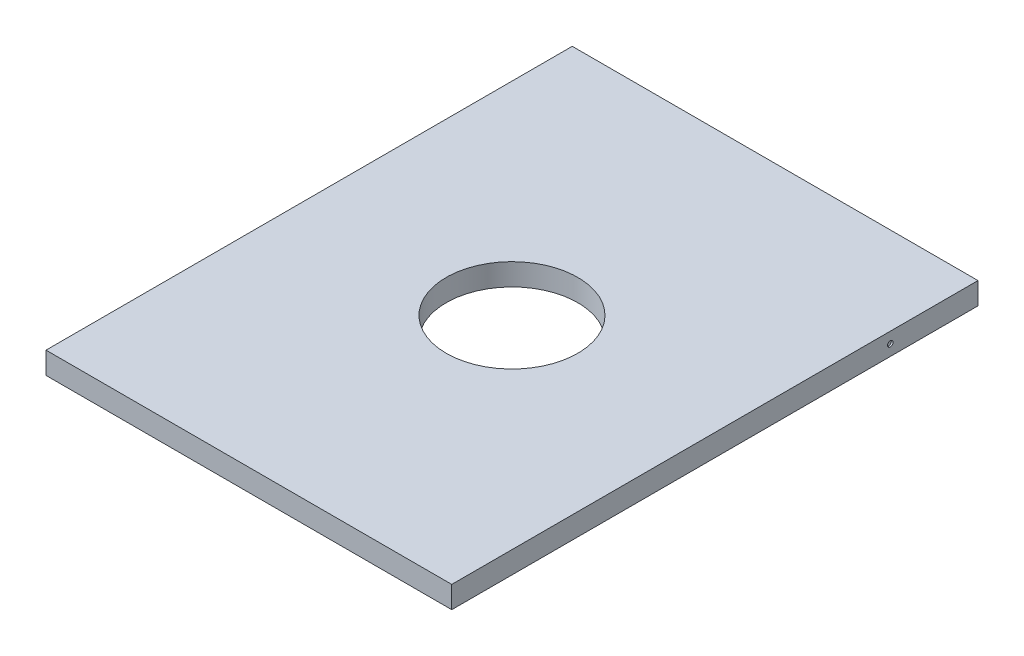
ISO-10303-21;
HEADER;
FILE_DESCRIPTION(('STEP AP214'),'2;1');
FILE_NAME('part.step','',(''),(''),'','','');
FILE_SCHEMA(('AUTOMOTIVE_DESIGN { 1 0 10303 214 1 1 1 1 }'));
ENDSEC;
DATA;
#1=APPLICATION_CONTEXT('core data for automotive mechanical design processes');
#2=APPLICATION_PROTOCOL_DEFINITION('international standard','automotive_design',2000,#1);
#3=PRODUCT_CONTEXT('',#1,'mechanical');
#4=PRODUCT('Part','Part','',(#3));
#5=PRODUCT_RELATED_PRODUCT_CATEGORY('part','',(#4));
#6=PRODUCT_DEFINITION_FORMATION('','',#4);
#7=PRODUCT_DEFINITION_CONTEXT('part definition',#1,'design');
#8=PRODUCT_DEFINITION('design','',#6,#7);
#9=PRODUCT_DEFINITION_SHAPE('','',#8);
#10=(LENGTH_UNIT() NAMED_UNIT(*) SI_UNIT(.MILLI.,.METRE.));
#11=(NAMED_UNIT(*) PLANE_ANGLE_UNIT() SI_UNIT($,.RADIAN.));
#12=(NAMED_UNIT(*) SI_UNIT($,.STERADIAN.) SOLID_ANGLE_UNIT());
#13=UNCERTAINTY_MEASURE_WITH_UNIT(LENGTH_MEASURE(1.E-05),#10,'distance_accuracy_value','');
#14=(GEOMETRIC_REPRESENTATION_CONTEXT(3) GLOBAL_UNCERTAINTY_ASSIGNED_CONTEXT((#13)) GLOBAL_UNIT_ASSIGNED_CONTEXT((#10,
#11,#12)) REPRESENTATION_CONTEXT('',''));
#15=CARTESIAN_POINT('',(0.,0.,0.));
#16=DIRECTION('',(0.,0.,1.));
#17=DIRECTION('',(1.,0.,0.));
#18=AXIS2_PLACEMENT_3D('',#15,#16,#17);
#19=CARTESIAN_POINT('',(0.,6.35,0.));
#20=DIRECTION('',(0.,-1.,0.));
#21=DIRECTION('',(0.,0.,-1.));
#22=AXIS2_PLACEMENT_3D('',#19,#20,#21);
#23=PLANE('',#22);
#24=DIRECTION('',(0.,0.,-1.));
#25=VECTOR('',#24,1.);
#26=CARTESIAN_POINT('',(58.7502,6.35,76.2));
#27=LINE('',#26,#25);
#28=CARTESIAN_POINT('',(58.7502,6.35,76.2));
#29=VERTEX_POINT('',#28);
#30=CARTESIAN_POINT('',(58.7502,6.35,-76.2));
#31=VERTEX_POINT('',#30);
#32=EDGE_CURVE('E85',#29,#31,#27,.T.);
#33=ORIENTED_EDGE('',*,*,#32,.T.);
#34=DIRECTION('',(-1.,0.,0.));
#35=VECTOR('',#34,1.);
#36=CARTESIAN_POINT('',(-58.7502,6.35,-76.2));
#37=LINE('',#36,#35);
#38=CARTESIAN_POINT('',(-58.7502,6.35,-76.2));
#39=VERTEX_POINT('',#38);
#40=EDGE_CURVE('E80',#31,#39,#37,.T.);
#41=ORIENTED_EDGE('',*,*,#40,.T.);
#42=DIRECTION('',(0.,0.,1.));
#43=VECTOR('',#42,1.);
#44=CARTESIAN_POINT('',(-58.7502,6.35,76.2));
#45=LINE('',#44,#43);
#46=CARTESIAN_POINT('',(-58.7502,6.35,76.2));
#47=VERTEX_POINT('',#46);
#48=EDGE_CURVE('E83',#39,#47,#45,.T.);
#49=ORIENTED_EDGE('',*,*,#48,.T.);
#50=DIRECTION('',(1.,0.,0.));
#51=VECTOR('',#50,1.);
#52=CARTESIAN_POINT('',(-58.7502,6.35,76.2));
#53=LINE('',#52,#51);
#54=EDGE_CURVE('E50',#47,#29,#53,.T.);
#55=ORIENTED_EDGE('',*,*,#54,.T.);
#56=EDGE_LOOP('',(#33,#41,#49,#55));
#57=FACE_BOUND('',#56,.T.);
#58=CARTESIAN_POINT('',(0.,6.35,0.));
#59=DIRECTION('',(0.,1.,0.));
#60=DIRECTION('',(0.,0.,1.));
#61=AXIS2_PLACEMENT_3D('',#58,#59,#60);
#62=CIRCLE('',#61,19.05);
#63=CARTESIAN_POINT('',(0.,6.35,19.05));
#64=VERTEX_POINT('',#63);
#65=EDGE_CURVE('E100',#64,#64,#62,.T.);
#66=ORIENTED_EDGE('',*,*,#65,.F.);
#67=EDGE_LOOP('',(#66));
#68=FACE_BOUND('',#67,.T.);
#69=ADVANCED_FACE('F33',(#57,#68),#23,.F.);
#70=CARTESIAN_POINT('',(0.,0.,0.));
#71=DIRECTION('',(0.,-1.,0.));
#72=DIRECTION('',(0.,0.,-1.));
#73=AXIS2_PLACEMENT_3D('',#70,#71,#72);
#74=PLANE('',#73);
#75=DIRECTION('',(0.,0.,-1.));
#76=VECTOR('',#75,1.);
#77=CARTESIAN_POINT('',(58.7502,0.,76.2));
#78=LINE('',#77,#76);
#79=CARTESIAN_POINT('',(58.7502,0.,76.2));
#80=VERTEX_POINT('',#79);
#81=CARTESIAN_POINT('',(58.7502,0.,-76.2));
#82=VERTEX_POINT('',#81);
#83=EDGE_CURVE('E97',#80,#82,#78,.T.);
#84=ORIENTED_EDGE('',*,*,#83,.F.);
#85=DIRECTION('',(1.,0.,0.));
#86=VECTOR('',#85,1.);
#87=CARTESIAN_POINT('',(-58.7502,0.,76.2));
#88=LINE('',#87,#86);
#89=CARTESIAN_POINT('',(-58.7502,0.,76.2));
#90=VERTEX_POINT('',#89);
#91=EDGE_CURVE('E73',#90,#80,#88,.T.);
#92=ORIENTED_EDGE('',*,*,#91,.F.);
#93=DIRECTION('',(0.,0.,1.));
#94=VECTOR('',#93,1.);
#95=CARTESIAN_POINT('',(-58.7502,0.,76.2));
#96=LINE('',#95,#94);
#97=CARTESIAN_POINT('',(-58.7502,0.,-76.2));
#98=VERTEX_POINT('',#97);
#99=EDGE_CURVE('E67',#98,#90,#96,.T.);
#100=ORIENTED_EDGE('',*,*,#99,.F.);
#101=DIRECTION('',(-1.,0.,0.));
#102=VECTOR('',#101,1.);
#103=CARTESIAN_POINT('',(-58.7502,0.,-76.2));
#104=LINE('',#103,#102);
#105=EDGE_CURVE('E89',#82,#98,#104,.T.);
#106=ORIENTED_EDGE('',*,*,#105,.F.);
#107=EDGE_LOOP('',(#84,#92,#100,#106));
#108=FACE_BOUND('',#107,.T.);
#109=CARTESIAN_POINT('',(0.,0.,0.));
#110=DIRECTION('',(0.,1.,0.));
#111=DIRECTION('',(0.,0.,1.));
#112=AXIS2_PLACEMENT_3D('',#109,#110,#111);
#113=CIRCLE('',#112,19.05);
#114=CARTESIAN_POINT('',(0.,0.,19.05));
#115=VERTEX_POINT('',#114);
#116=EDGE_CURVE('E112',#115,#115,#113,.T.);
#117=ORIENTED_EDGE('',*,*,#116,.T.);
#118=EDGE_LOOP('',(#117));
#119=FACE_BOUND('',#118,.T.);
#120=ADVANCED_FACE('F108',(#108,#119),#74,.T.);
#121=CARTESIAN_POINT('',(58.7502,6.35,76.2));
#122=DIRECTION('',(-1.,0.,0.));
#123=DIRECTION('',(0.,0.,1.));
#124=AXIS2_PLACEMENT_3D('',#121,#122,#123);
#125=PLANE('',#124);
#126=CARTESIAN_POINT('',(58.7502,3.175,-50.8));
#127=DIRECTION('',(1.,0.,0.));
#128=DIRECTION('',(0.,0.,-1.));
#129=AXIS2_PLACEMENT_3D('',#126,#127,#128);
#130=CIRCLE('',#129,0.787399999999992);
#131=CARTESIAN_POINT('',(58.7502,3.175,-51.5874));
#132=VERTEX_POINT('',#131);
#133=EDGE_CURVE('E124',#132,#132,#130,.T.);
#134=ORIENTED_EDGE('',*,*,#133,.F.);
#135=EDGE_LOOP('',(#134));
#136=FACE_BOUND('',#135,.T.);
#137=ORIENTED_EDGE('',*,*,#83,.T.);
#138=DIRECTION('',(0.,-1.,0.));
#139=VECTOR('',#138,1.);
#140=CARTESIAN_POINT('',(58.7502,6.35,-76.2));
#141=LINE('',#140,#139);
#142=EDGE_CURVE('E11',#31,#82,#141,.T.);
#143=ORIENTED_EDGE('',*,*,#142,.F.);
#144=ORIENTED_EDGE('',*,*,#32,.F.);
#145=DIRECTION('',(0.,-1.,0.));
#146=VECTOR('',#145,1.);
#147=CARTESIAN_POINT('',(58.7502,6.35,76.2));
#148=LINE('',#147,#146);
#149=EDGE_CURVE('E93',#29,#80,#148,.T.);
#150=ORIENTED_EDGE('',*,*,#149,.T.);
#151=EDGE_LOOP('',(#137,#143,#144,#150));
#152=FACE_BOUND('',#151,.T.);
#153=ADVANCED_FACE('F35',(#136,#152),#125,.F.);
#154=CARTESIAN_POINT('',(-58.7502,6.35,-76.2));
#155=DIRECTION('',(0.,0.,1.));
#156=DIRECTION('',(1.,0.,0.));
#157=AXIS2_PLACEMENT_3D('',#154,#155,#156);
#158=PLANE('',#157);
#159=CARTESIAN_POINT('',(0.,3.175,-76.2));
#160=DIRECTION('',(0.,0.,-1.));
#161=DIRECTION('',(-1.,0.,0.));
#162=AXIS2_PLACEMENT_3D('',#159,#160,#161);
#163=CIRCLE('',#162,1.7272);
#164=CARTESIAN_POINT('',(-1.72719999999999,3.175,-76.2));
#165=VERTEX_POINT('',#164);
#166=EDGE_CURVE('E130',#165,#165,#163,.T.);
#167=ORIENTED_EDGE('',*,*,#166,.F.);
#168=EDGE_LOOP('',(#167));
#169=FACE_BOUND('',#168,.T.);
#170=ORIENTED_EDGE('',*,*,#105,.T.);
#171=DIRECTION('',(0.,-1.,0.));
#172=VECTOR('',#171,1.);
#173=CARTESIAN_POINT('',(-58.7502,6.35,-76.2));
#174=LINE('',#173,#172);
#175=EDGE_CURVE('E42',#39,#98,#174,.T.);
#176=ORIENTED_EDGE('',*,*,#175,.F.);
#177=ORIENTED_EDGE('',*,*,#40,.F.);
#178=ORIENTED_EDGE('',*,*,#142,.T.);
#179=EDGE_LOOP('',(#170,#176,#177,#178));
#180=FACE_BOUND('',#179,.T.);
#181=ADVANCED_FACE('F88',(#169,#180),#158,.F.);
#182=CARTESIAN_POINT('',(-58.7502,6.35,76.2));
#183=DIRECTION('',(1.,0.,0.));
#184=DIRECTION('',(0.,0.,-1.));
#185=AXIS2_PLACEMENT_3D('',#182,#183,#184);
#186=PLANE('',#185);
#187=CARTESIAN_POINT('',(-58.7502,3.17499999999998,-50.8));
#188=DIRECTION('',(-1.,0.,0.));
#189=DIRECTION('',(0.,0.,1.));
#190=AXIS2_PLACEMENT_3D('',#187,#188,#189);
#191=CIRCLE('',#190,0.787399999999999);
#192=CARTESIAN_POINT('',(-58.7502,3.17499999999998,-50.0126));
#193=VERTEX_POINT('',#192);
#194=EDGE_CURVE('E118',#193,#193,#191,.T.);
#195=ORIENTED_EDGE('',*,*,#194,.F.);
#196=EDGE_LOOP('',(#195));
#197=FACE_BOUND('',#196,.T.);
#198=ORIENTED_EDGE('',*,*,#99,.T.);
#199=DIRECTION('',(0.,-1.,0.));
#200=VECTOR('',#199,1.);
#201=CARTESIAN_POINT('',(-58.7502,6.35,76.2));
#202=LINE('',#201,#200);
#203=EDGE_CURVE('E90',#47,#90,#202,.T.);
#204=ORIENTED_EDGE('',*,*,#203,.F.);
#205=ORIENTED_EDGE('',*,*,#48,.F.);
#206=ORIENTED_EDGE('',*,*,#175,.T.);
#207=EDGE_LOOP('',(#198,#204,#205,#206));
#208=FACE_BOUND('',#207,.T.);
#209=ADVANCED_FACE('F91',(#197,#208),#186,.F.);
#210=CARTESIAN_POINT('',(-58.7502,6.35,76.2));
#211=DIRECTION('',(0.,0.,-1.));
#212=DIRECTION('',(-1.,0.,0.));
#213=AXIS2_PLACEMENT_3D('',#210,#211,#212);
#214=PLANE('',#213);
#215=ORIENTED_EDGE('',*,*,#91,.T.);
#216=ORIENTED_EDGE('',*,*,#149,.F.);
#217=ORIENTED_EDGE('',*,*,#54,.F.);
#218=ORIENTED_EDGE('',*,*,#203,.T.);
#219=EDGE_LOOP('',(#215,#216,#217,#218));
#220=FACE_BOUND('',#219,.T.);
#221=ADVANCED_FACE('F105',(#220),#214,.F.);
#222=CARTESIAN_POINT('',(0.,6.35,0.));
#223=DIRECTION('',(0.,-1.,0.));
#224=DIRECTION('',(0.,0.,-1.));
#225=AXIS2_PLACEMENT_3D('',#222,#223,#224);
#226=CYLINDRICAL_SURFACE('',#225,19.05);
#227=ORIENTED_EDGE('',*,*,#65,.T.);
#228=EDGE_LOOP('',(#227));
#229=FACE_BOUND('',#228,.T.);
#230=ORIENTED_EDGE('',*,*,#116,.F.);
#231=EDGE_LOOP('',(#230));
#232=FACE_BOUND('',#231,.T.);
#233=ADVANCED_FACE('F162',(#229,#232),#226,.F.);
#234=CARTESIAN_POINT('',(-58.2422,3.17499999999998,-50.8));
#235=DIRECTION('',(-1.,0.,0.));
#236=DIRECTION('',(0.,0.,1.));
#237=AXIS2_PLACEMENT_3D('',#234,#235,#236);
#238=CYLINDRICAL_SURFACE('',#237,0.787399999999999);
#239=CARTESIAN_POINT('',(-58.2422,3.17499999999998,-50.8));
#240=DIRECTION('',(-1.,0.,0.));
#241=DIRECTION('',(0.,0.,1.));
#242=AXIS2_PLACEMENT_3D('',#239,#240,#241);
#243=CIRCLE('',#242,0.787399999999999);
#244=CARTESIAN_POINT('',(-58.2422,3.17499999999998,-50.0126));
#245=VERTEX_POINT('',#244);
#246=EDGE_CURVE('E115',#245,#245,#243,.T.);
#247=ORIENTED_EDGE('',*,*,#246,.F.);
#248=EDGE_LOOP('',(#247));
#249=FACE_BOUND('',#248,.T.);
#250=ORIENTED_EDGE('',*,*,#194,.T.);
#251=EDGE_LOOP('',(#250));
#252=FACE_BOUND('',#251,.T.);
#253=ADVANCED_FACE('F169',(#249,#252),#238,.F.);
#254=CARTESIAN_POINT('',(-58.2422,3.17499999999998,-50.8));
#255=DIRECTION('',(-1.,0.,0.));
#256=DIRECTION('',(0.,0.,1.));
#257=AXIS2_PLACEMENT_3D('',#254,#255,#256);
#258=PLANE('',#257);
#259=ORIENTED_EDGE('',*,*,#246,.T.);
#260=EDGE_LOOP('',(#259));
#261=FACE_BOUND('',#260,.T.);
#262=ADVANCED_FACE('F174',(#261),#258,.T.);
#263=CARTESIAN_POINT('',(58.2422,3.175,-50.8));
#264=DIRECTION('',(1.,0.,0.));
#265=DIRECTION('',(0.,0.,-1.));
#266=AXIS2_PLACEMENT_3D('',#263,#264,#265);
#267=CYLINDRICAL_SURFACE('',#266,0.787399999999992);
#268=CARTESIAN_POINT('',(58.2422,3.175,-50.8));
#269=DIRECTION('',(1.,0.,0.));
#270=DIRECTION('',(0.,0.,-1.));
#271=AXIS2_PLACEMENT_3D('',#268,#269,#270);
#272=CIRCLE('',#271,0.787399999999992);
#273=CARTESIAN_POINT('',(58.2422,3.175,-51.5874));
#274=VERTEX_POINT('',#273);
#275=EDGE_CURVE('E121',#274,#274,#272,.T.);
#276=ORIENTED_EDGE('',*,*,#275,.F.);
#277=EDGE_LOOP('',(#276));
#278=FACE_BOUND('',#277,.T.);
#279=ORIENTED_EDGE('',*,*,#133,.T.);
#280=EDGE_LOOP('',(#279));
#281=FACE_BOUND('',#280,.T.);
#282=ADVANCED_FACE('F182',(#278,#281),#267,.F.);
#283=CARTESIAN_POINT('',(58.2422,3.175,-50.8));
#284=DIRECTION('',(1.,0.,0.));
#285=DIRECTION('',(0.,0.,-1.));
#286=AXIS2_PLACEMENT_3D('',#283,#284,#285);
#287=PLANE('',#286);
#288=ORIENTED_EDGE('',*,*,#275,.T.);
#289=EDGE_LOOP('',(#288));
#290=FACE_BOUND('',#289,.T.);
#291=ADVANCED_FACE('F141',(#290),#287,.T.);
#292=CARTESIAN_POINT('',(0.,3.175,-69.85));
#293=DIRECTION('',(0.,0.,-1.));
#294=DIRECTION('',(-1.,0.,0.));
#295=AXIS2_PLACEMENT_3D('',#292,#293,#294);
#296=CYLINDRICAL_SURFACE('',#295,1.7272);
#297=CARTESIAN_POINT('',(0.,3.175,-69.85));
#298=DIRECTION('',(0.,0.,-1.));
#299=DIRECTION('',(-1.,0.,0.));
#300=AXIS2_PLACEMENT_3D('',#297,#298,#299);
#301=CIRCLE('',#300,1.7272);
#302=CARTESIAN_POINT('',(-1.72719999999999,3.175,-69.85));
#303=VERTEX_POINT('',#302);
#304=EDGE_CURVE('E127',#303,#303,#301,.T.);
#305=ORIENTED_EDGE('',*,*,#304,.F.);
#306=EDGE_LOOP('',(#305));
#307=FACE_BOUND('',#306,.T.);
#308=ORIENTED_EDGE('',*,*,#166,.T.);
#309=EDGE_LOOP('',(#308));
#310=FACE_BOUND('',#309,.T.);
#311=ADVANCED_FACE('F138',(#307,#310),#296,.F.);
#312=CARTESIAN_POINT('',(0.,3.175,-69.85));
#313=DIRECTION('',(0.,0.,-1.));
#314=DIRECTION('',(-1.,0.,0.));
#315=AXIS2_PLACEMENT_3D('',#312,#313,#314);
#316=PLANE('',#315);
#317=ORIENTED_EDGE('',*,*,#304,.T.);
#318=EDGE_LOOP('',(#317));
#319=FACE_BOUND('',#318,.T.);
#320=ADVANCED_FACE('F136',(#319),#316,.T.);
#321=CLOSED_SHELL('',(#69,#120,#153,#181,#209,#221,#233,#253,#262,#282,#291,#311,#320));
#322=MANIFOLD_SOLID_BREP('B2',#321);
#323=ADVANCED_BREP_SHAPE_REPRESENTATION('',(#18,#322),#14);
#324=SHAPE_DEFINITION_REPRESENTATION(#9,#323);
ENDSEC;
END-ISO-10303-21;
